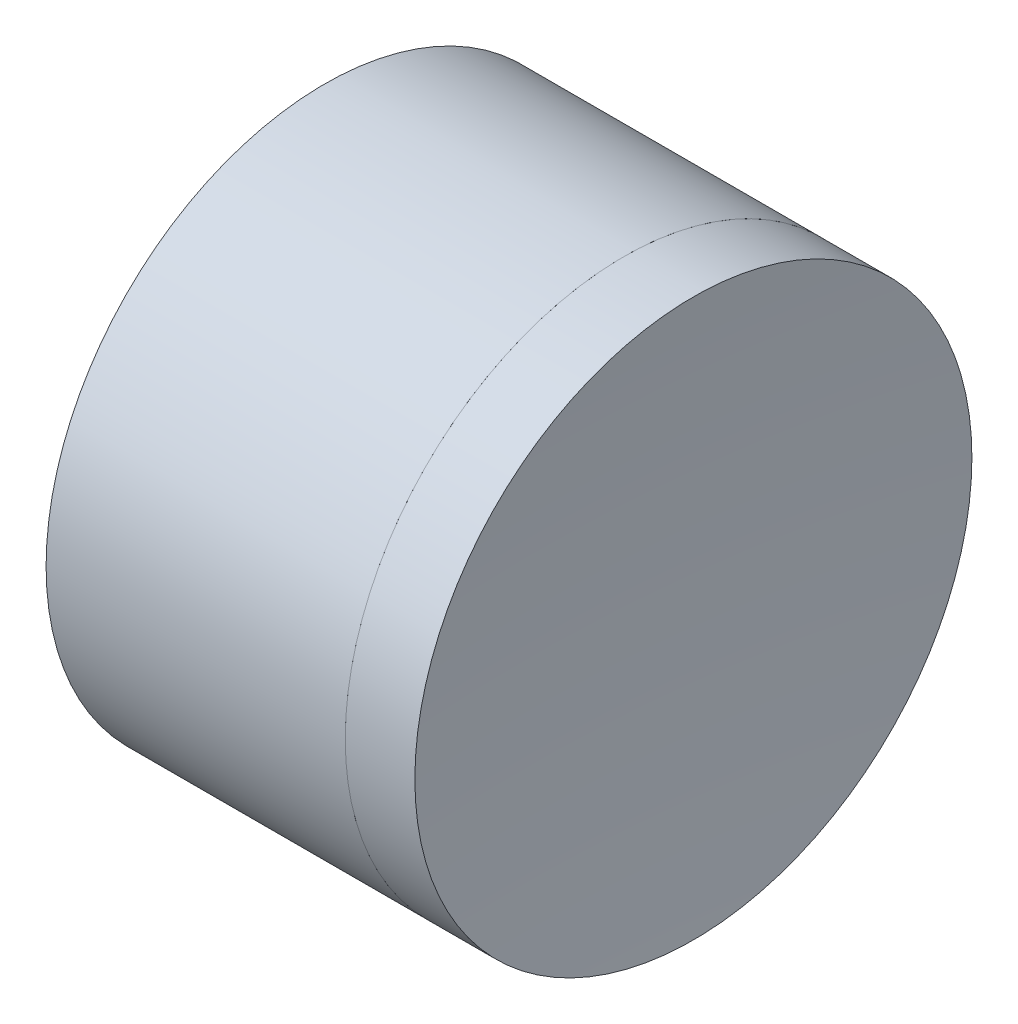
ISO-10303-21;
HEADER;
FILE_DESCRIPTION(('STEP AP214'),'2;1');
FILE_NAME('part.step','',(''),(''),'','','');
FILE_SCHEMA(('AUTOMOTIVE_DESIGN { 1 0 10303 214 1 1 1 1 }'));
ENDSEC;
DATA;
#1=APPLICATION_CONTEXT('core data for automotive mechanical design processes');
#2=APPLICATION_PROTOCOL_DEFINITION('international standard','automotive_design',2000,#1);
#3=PRODUCT_CONTEXT('',#1,'mechanical');
#4=PRODUCT('Part','Part','',(#3));
#5=PRODUCT_RELATED_PRODUCT_CATEGORY('part','',(#4));
#6=PRODUCT_DEFINITION_FORMATION('','',#4);
#7=PRODUCT_DEFINITION_CONTEXT('part definition',#1,'design');
#8=PRODUCT_DEFINITION('design','',#6,#7);
#9=PRODUCT_DEFINITION_SHAPE('','',#8);
#10=(LENGTH_UNIT() NAMED_UNIT(*) SI_UNIT(.MILLI.,.METRE.));
#11=(NAMED_UNIT(*) PLANE_ANGLE_UNIT() SI_UNIT($,.RADIAN.));
#12=(NAMED_UNIT(*) SI_UNIT($,.STERADIAN.) SOLID_ANGLE_UNIT());
#13=UNCERTAINTY_MEASURE_WITH_UNIT(LENGTH_MEASURE(1.E-05),#10,'distance_accuracy_value','');
#14=(GEOMETRIC_REPRESENTATION_CONTEXT(3) GLOBAL_UNCERTAINTY_ASSIGNED_CONTEXT((#13)) GLOBAL_UNIT_ASSIGNED_CONTEXT((#10,
#11,#12)) REPRESENTATION_CONTEXT('',''));
#15=CARTESIAN_POINT('',(0.,0.,0.));
#16=DIRECTION('',(0.,0.,1.));
#17=DIRECTION('',(1.,0.,0.));
#18=AXIS2_PLACEMENT_3D('',#15,#16,#17);
#19=CARTESIAN_POINT('',(252.192058369005,0.,0.));
#20=DIRECTION('',(-1.,0.,0.));
#21=DIRECTION('',(0.,0.,1.));
#22=AXIS2_PLACEMENT_3D('',#19,#20,#21);
#23=SPHERICAL_SURFACE('',#22,17.2600000000004);
#24=CARTESIAN_POINT('',(240.290058537043,0.,0.));
#25=DIRECTION('',(-1.,0.,0.));
#26=DIRECTION('',(0.,0.,1.));
#27=AXIS2_PLACEMENT_3D('',#24,#25,#26);
#28=CIRCLE('',#27,12.5);
#29=CARTESIAN_POINT('',(240.290058537043,0.,12.5));
#30=VERTEX_POINT('',#29);
#31=EDGE_CURVE('E11',#30,#30,#28,.T.);
#32=ORIENTED_EDGE('',*,*,#31,.T.);
#33=EDGE_LOOP('',(#32));
#34=FACE_BOUND('',#33,.T.);
#35=ADVANCED_FACE('F45',(#34),#23,.T.);
#36=CARTESIAN_POINT('',(226.864350004078,0.,0.));
#37=DIRECTION('',(-1.,0.,0.));
#38=DIRECTION('',(0.,0.,1.));
#39=AXIS2_PLACEMENT_3D('',#36,#37,#38);
#40=CYLINDRICAL_SURFACE('',#39,12.5);
#41=CARTESIAN_POINT('',(243.41431481402,0.,0.));
#42=DIRECTION('',(-1.,0.,0.));
#43=DIRECTION('',(0.,0.,1.));
#44=AXIS2_PLACEMENT_3D('',#41,#42,#43);
#45=CIRCLE('',#44,12.5);
#46=CARTESIAN_POINT('',(243.41431481402,0.,12.5));
#47=VERTEX_POINT('',#46);
#48=EDGE_CURVE('E51',#47,#47,#45,.T.);
#49=ORIENTED_EDGE('',*,*,#48,.T.);
#50=EDGE_LOOP('',(#49));
#51=FACE_BOUND('',#50,.T.);
#52=ORIENTED_EDGE('',*,*,#31,.F.);
#53=EDGE_LOOP('',(#52));
#54=FACE_BOUND('',#53,.T.);
#55=ADVANCED_FACE('F57',(#51,#54),#40,.T.);
#56=CARTESIAN_POINT('',(405.172058369004,0.,0.));
#57=DIRECTION('',(-1.,0.,0.));
#58=DIRECTION('',(0.,0.,-1.));
#59=AXIS2_PLACEMENT_3D('',#56,#57,#58);
#60=SPHERICAL_SURFACE('',#59,162.24);
#61=ORIENTED_EDGE('',*,*,#48,.F.);
#62=EDGE_LOOP('',(#61));
#63=FACE_BOUND('',#62,.T.);
#64=ADVANCED_FACE('F60',(#63),#60,.F.);
#65=CLOSED_SHELL('',(#35,#55,#64));
#66=MANIFOLD_SOLID_BREP('B2',#65);
#67=CARTESIAN_POINT('',(209.692058369005,0.,0.));
#68=DIRECTION('',(-1.,0.,0.));
#69=DIRECTION('',(0.,0.,1.));
#70=AXIS2_PLACEMENT_3D('',#67,#68,#69);
#71=SPHERICAL_SURFACE('',#70,21.24);
#72=CARTESIAN_POINT('',(226.864350004078,0.,0.));
#73=DIRECTION('',(-1.,0.,0.));
#74=DIRECTION('',(0.,0.,1.));
#75=AXIS2_PLACEMENT_3D('',#72,#73,#74);
#76=CIRCLE('',#75,12.5);
#77=CARTESIAN_POINT('',(226.864350004078,0.,12.5));
#78=VERTEX_POINT('',#77);
#79=EDGE_CURVE('E44',#78,#78,#76,.T.);
#80=ORIENTED_EDGE('',*,*,#79,.T.);
#81=EDGE_LOOP('',(#80));
#82=FACE_BOUND('',#81,.T.);
#83=ADVANCED_FACE('F86',(#82),#71,.F.);
#84=CARTESIAN_POINT('',(-0.816062176165804,0.,0.));
#85=DIRECTION('',(-1.,0.,0.));
#86=DIRECTION('',(0.,0.,1.));
#87=AXIS2_PLACEMENT_3D('',#84,#85,#86);
#88=CYLINDRICAL_SURFACE('',#87,12.5);
#89=CARTESIAN_POINT('',(240.290058537043,0.,0.));
#90=DIRECTION('',(-1.,0.,0.));
#91=DIRECTION('',(0.,0.,1.));
#92=AXIS2_PLACEMENT_3D('',#89,#90,#91);
#93=CIRCLE('',#92,12.5);
#94=CARTESIAN_POINT('',(240.290058537043,0.,12.5));
#95=VERTEX_POINT('',#94);
#96=EDGE_CURVE('E92',#95,#95,#93,.T.);
#97=ORIENTED_EDGE('',*,*,#96,.T.);
#98=EDGE_LOOP('',(#97));
#99=FACE_BOUND('',#98,.T.);
#100=ORIENTED_EDGE('',*,*,#79,.F.);
#101=EDGE_LOOP('',(#100));
#102=FACE_BOUND('',#101,.T.);
#103=ADVANCED_FACE('F98',(#99,#102),#88,.T.);
#104=CARTESIAN_POINT('',(252.192058369005,0.,0.));
#105=DIRECTION('',(-1.,0.,0.));
#106=DIRECTION('',(0.,0.,-1.));
#107=AXIS2_PLACEMENT_3D('',#104,#105,#106);
#108=SPHERICAL_SURFACE('',#107,17.2600000000004);
#109=ORIENTED_EDGE('',*,*,#96,.F.);
#110=EDGE_LOOP('',(#109));
#111=FACE_BOUND('',#110,.T.);
#112=ADVANCED_FACE('F101',(#111),#108,.F.);
#113=CLOSED_SHELL('',(#83,#103,#112));
#114=MANIFOLD_SOLID_BREP('B6',#113);
#115=ADVANCED_BREP_SHAPE_REPRESENTATION('',(#18,#66,#114),#14);
#116=SHAPE_DEFINITION_REPRESENTATION(#9,#115);
ENDSEC;
END-ISO-10303-21;
